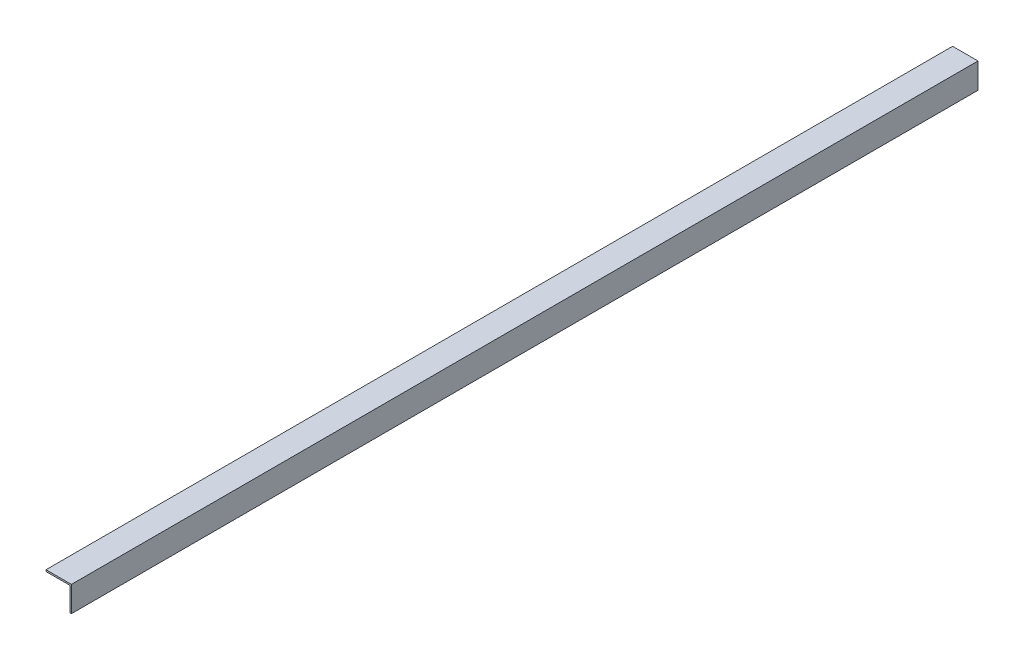
ISO-10303-21;
HEADER;
FILE_DESCRIPTION(('STEP AP214'),'2;1');
FILE_NAME('part.step','',(''),(''),'','','');
FILE_SCHEMA(('AUTOMOTIVE_DESIGN { 1 0 10303 214 1 1 1 1 }'));
ENDSEC;
DATA;
#1=APPLICATION_CONTEXT('core data for automotive mechanical design processes');
#2=APPLICATION_PROTOCOL_DEFINITION('international standard','automotive_design',2000,#1);
#3=PRODUCT_CONTEXT('',#1,'mechanical');
#4=PRODUCT('Part','Part','',(#3));
#5=PRODUCT_RELATED_PRODUCT_CATEGORY('part','',(#4));
#6=PRODUCT_DEFINITION_FORMATION('','',#4);
#7=PRODUCT_DEFINITION_CONTEXT('part definition',#1,'design');
#8=PRODUCT_DEFINITION('design','',#6,#7);
#9=PRODUCT_DEFINITION_SHAPE('','',#8);
#10=(LENGTH_UNIT() NAMED_UNIT(*) SI_UNIT(.MILLI.,.METRE.));
#11=(NAMED_UNIT(*) PLANE_ANGLE_UNIT() SI_UNIT($,.RADIAN.));
#12=(NAMED_UNIT(*) SI_UNIT($,.STERADIAN.) SOLID_ANGLE_UNIT());
#13=UNCERTAINTY_MEASURE_WITH_UNIT(LENGTH_MEASURE(1.E-05),#10,'distance_accuracy_value','');
#14=(GEOMETRIC_REPRESENTATION_CONTEXT(3) GLOBAL_UNCERTAINTY_ASSIGNED_CONTEXT((#13)) GLOBAL_UNIT_ASSIGNED_CONTEXT((#10,
#11,#12)) REPRESENTATION_CONTEXT('',''));
#15=CARTESIAN_POINT('',(0.,0.,0.));
#16=DIRECTION('',(0.,0.,1.));
#17=DIRECTION('',(1.,0.,0.));
#18=AXIS2_PLACEMENT_3D('',#15,#16,#17);
#19=CARTESIAN_POINT('',(0.,-50.8,1812.925));
#20=DIRECTION('',(-1.,0.,0.));
#21=DIRECTION('',(0.,0.,1.));
#22=AXIS2_PLACEMENT_3D('',#19,#20,#21);
#23=PLANE('',#22);
#24=DIRECTION('',(0.,1.,0.));
#25=VECTOR('',#24,1.);
#26=CARTESIAN_POINT('',(0.,-50.8,0.));
#27=LINE('',#26,#25);
#28=CARTESIAN_POINT('',(0.,-50.8,0.));
#29=VERTEX_POINT('',#28);
#30=CARTESIAN_POINT('',(0.,0.,0.));
#31=VERTEX_POINT('',#30);
#32=EDGE_CURVE('E123',#29,#31,#27,.T.);
#33=ORIENTED_EDGE('',*,*,#32,.T.);
#34=DIRECTION('',(0.,0.,-1.));
#35=VECTOR('',#34,1.);
#36=CARTESIAN_POINT('',(0.,0.,1812.925));
#37=LINE('',#36,#35);
#38=CARTESIAN_POINT('',(0.,0.,1812.925));
#39=VERTEX_POINT('',#38);
#40=EDGE_CURVE('E11',#39,#31,#37,.T.);
#41=ORIENTED_EDGE('',*,*,#40,.F.);
#42=DIRECTION('',(0.,1.,0.));
#43=VECTOR('',#42,1.);
#44=CARTESIAN_POINT('',(0.,-50.8,1812.925));
#45=LINE('',#44,#43);
#46=CARTESIAN_POINT('',(0.,-50.8,1812.925));
#47=VERTEX_POINT('',#46);
#48=EDGE_CURVE('E133',#47,#39,#45,.T.);
#49=ORIENTED_EDGE('',*,*,#48,.F.);
#50=DIRECTION('',(0.,0.,-1.));
#51=VECTOR('',#50,1.);
#52=CARTESIAN_POINT('',(0.,-50.8,1812.925));
#53=LINE('',#52,#51);
#54=EDGE_CURVE('E119',#47,#29,#53,.T.);
#55=ORIENTED_EDGE('',*,*,#54,.T.);
#56=EDGE_LOOP('',(#33,#41,#49,#55));
#57=FACE_BOUND('',#56,.T.);
#58=ADVANCED_FACE('F39',(#57),#23,.F.);
#59=CARTESIAN_POINT('',(0.,0.,1812.925));
#60=DIRECTION('',(0.,-1.,0.));
#61=DIRECTION('',(0.,0.,-1.));
#62=AXIS2_PLACEMENT_3D('',#59,#60,#61);
#63=PLANE('',#62);
#64=DIRECTION('',(-1.,0.,0.));
#65=VECTOR('',#64,1.);
#66=CARTESIAN_POINT('',(0.,0.,0.));
#67=LINE('',#66,#65);
#68=CARTESIAN_POINT('',(-50.8,0.,0.));
#69=VERTEX_POINT('',#68);
#70=EDGE_CURVE('E126',#31,#69,#67,.T.);
#71=ORIENTED_EDGE('',*,*,#70,.T.);
#72=DIRECTION('',(0.,0.,-1.));
#73=VECTOR('',#72,1.);
#74=CARTESIAN_POINT('',(-50.8,0.,1812.925));
#75=LINE('',#74,#73);
#76=CARTESIAN_POINT('',(-50.8,0.,1812.925));
#77=VERTEX_POINT('',#76);
#78=EDGE_CURVE('E47',#77,#69,#75,.T.);
#79=ORIENTED_EDGE('',*,*,#78,.F.);
#80=DIRECTION('',(-1.,0.,0.));
#81=VECTOR('',#80,1.);
#82=CARTESIAN_POINT('',(0.,0.,1812.925));
#83=LINE('',#82,#81);
#84=EDGE_CURVE('E92',#39,#77,#83,.T.);
#85=ORIENTED_EDGE('',*,*,#84,.F.);
#86=ORIENTED_EDGE('',*,*,#40,.T.);
#87=EDGE_LOOP('',(#71,#79,#85,#86));
#88=FACE_BOUND('',#87,.T.);
#89=ADVANCED_FACE('F157',(#88),#63,.F.);
#90=CARTESIAN_POINT('',(-50.8,0.,1812.925));
#91=DIRECTION('',(1.,0.,0.));
#92=DIRECTION('',(0.,0.,-1.));
#93=AXIS2_PLACEMENT_3D('',#90,#91,#92);
#94=PLANE('',#93);
#95=DIRECTION('',(0.,-1.,0.));
#96=VECTOR('',#95,1.);
#97=CARTESIAN_POINT('',(-50.8,0.,0.));
#98=LINE('',#97,#96);
#99=CARTESIAN_POINT('',(-50.8,-3.17500000000001,0.));
#100=VERTEX_POINT('',#99);
#101=EDGE_CURVE('E128',#69,#100,#98,.T.);
#102=ORIENTED_EDGE('',*,*,#101,.T.);
#103=DIRECTION('',(0.,0.,-1.));
#104=VECTOR('',#103,1.);
#105=CARTESIAN_POINT('',(-50.8,-3.17500000000001,1812.925));
#106=LINE('',#105,#104);
#107=CARTESIAN_POINT('',(-50.8,-3.17500000000001,1812.925));
#108=VERTEX_POINT('',#107);
#109=EDGE_CURVE('E114',#108,#100,#106,.T.);
#110=ORIENTED_EDGE('',*,*,#109,.F.);
#111=DIRECTION('',(0.,-1.,0.));
#112=VECTOR('',#111,1.);
#113=CARTESIAN_POINT('',(-50.8,0.,1812.925));
#114=LINE('',#113,#112);
#115=EDGE_CURVE('E105',#77,#108,#114,.T.);
#116=ORIENTED_EDGE('',*,*,#115,.F.);
#117=ORIENTED_EDGE('',*,*,#78,.T.);
#118=EDGE_LOOP('',(#102,#110,#116,#117));
#119=FACE_BOUND('',#118,.T.);
#120=ADVANCED_FACE('F139',(#119),#94,.F.);
#121=CARTESIAN_POINT('',(-50.8,-3.17500000000001,1812.925));
#122=DIRECTION('',(0.,1.,0.));
#123=DIRECTION('',(0.,0.,1.));
#124=AXIS2_PLACEMENT_3D('',#121,#122,#123);
#125=PLANE('',#124);
#126=DIRECTION('',(1.,0.,0.));
#127=VECTOR('',#126,1.);
#128=CARTESIAN_POINT('',(-50.8,-3.17500000000001,0.));
#129=LINE('',#128,#127);
#130=CARTESIAN_POINT('',(-3.17500000000001,-3.17500000000001,0.));
#131=VERTEX_POINT('',#130);
#132=EDGE_CURVE('E113',#100,#131,#129,.T.);
#133=ORIENTED_EDGE('',*,*,#132,.T.);
#134=DIRECTION('',(0.,0.,-1.));
#135=VECTOR('',#134,1.);
#136=CARTESIAN_POINT('',(-3.17500000000001,-3.17500000000001,1812.925));
#137=LINE('',#136,#135);
#138=CARTESIAN_POINT('',(-3.17500000000001,-3.17500000000001,1812.925));
#139=VERTEX_POINT('',#138);
#140=EDGE_CURVE('E110',#139,#131,#137,.T.);
#141=ORIENTED_EDGE('',*,*,#140,.F.);
#142=DIRECTION('',(1.,0.,0.));
#143=VECTOR('',#142,1.);
#144=CARTESIAN_POINT('',(-50.8,-3.17500000000001,1812.925));
#145=LINE('',#144,#143);
#146=EDGE_CURVE('E99',#108,#139,#145,.T.);
#147=ORIENTED_EDGE('',*,*,#146,.F.);
#148=ORIENTED_EDGE('',*,*,#109,.T.);
#149=EDGE_LOOP('',(#133,#141,#147,#148));
#150=FACE_BOUND('',#149,.T.);
#151=ADVANCED_FACE('F111',(#150),#125,.F.);
#152=CARTESIAN_POINT('',(-3.17500000000001,-3.17500000000001,1812.925));
#153=DIRECTION('',(1.,0.,0.));
#154=DIRECTION('',(0.,1.,0.));
#155=AXIS2_PLACEMENT_3D('',#152,#153,#154);
#156=PLANE('',#155);
#157=DIRECTION('',(0.,-1.,0.));
#158=VECTOR('',#157,1.);
#159=CARTESIAN_POINT('',(-3.17500000000001,-3.17500000000001,0.));
#160=LINE('',#159,#158);
#161=CARTESIAN_POINT('',(-3.175,-50.8,0.));
#162=VERTEX_POINT('',#161);
#163=EDGE_CURVE('E78',#131,#162,#160,.T.);
#164=ORIENTED_EDGE('',*,*,#163,.T.);
#165=DIRECTION('',(0.,0.,-1.));
#166=VECTOR('',#165,1.);
#167=CARTESIAN_POINT('',(-3.175,-50.8,1812.925));
#168=LINE('',#167,#166);
#169=CARTESIAN_POINT('',(-3.175,-50.8,1812.925));
#170=VERTEX_POINT('',#169);
#171=EDGE_CURVE('E115',#170,#162,#168,.T.);
#172=ORIENTED_EDGE('',*,*,#171,.F.);
#173=DIRECTION('',(0.,-1.,0.));
#174=VECTOR('',#173,1.);
#175=CARTESIAN_POINT('',(-3.17500000000001,-3.17500000000001,1812.925));
#176=LINE('',#175,#174);
#177=EDGE_CURVE('E103',#139,#170,#176,.T.);
#178=ORIENTED_EDGE('',*,*,#177,.F.);
#179=ORIENTED_EDGE('',*,*,#140,.T.);
#180=EDGE_LOOP('',(#164,#172,#178,#179));
#181=FACE_BOUND('',#180,.T.);
#182=ADVANCED_FACE('F117',(#181),#156,.F.);
#183=CARTESIAN_POINT('',(-3.175,-50.8,1812.925));
#184=DIRECTION('',(0.,1.,0.));
#185=DIRECTION('',(0.,0.,1.));
#186=AXIS2_PLACEMENT_3D('',#183,#184,#185);
#187=PLANE('',#186);
#188=DIRECTION('',(1.,0.,0.));
#189=VECTOR('',#188,1.);
#190=CARTESIAN_POINT('',(-3.175,-50.8,0.));
#191=LINE('',#190,#189);
#192=EDGE_CURVE('E84',#162,#29,#191,.T.);
#193=ORIENTED_EDGE('',*,*,#192,.T.);
#194=ORIENTED_EDGE('',*,*,#54,.F.);
#195=DIRECTION('',(1.,0.,0.));
#196=VECTOR('',#195,1.);
#197=CARTESIAN_POINT('',(-3.175,-50.8,1812.925));
#198=LINE('',#197,#196);
#199=EDGE_CURVE('E55',#170,#47,#198,.T.);
#200=ORIENTED_EDGE('',*,*,#199,.F.);
#201=ORIENTED_EDGE('',*,*,#171,.T.);
#202=EDGE_LOOP('',(#193,#194,#200,#201));
#203=FACE_BOUND('',#202,.T.);
#204=ADVANCED_FACE('F146',(#203),#187,.F.);
#205=CARTESIAN_POINT('',(0.,0.,1812.925));
#206=DIRECTION('',(0.,0.,1.));
#207=DIRECTION('',(1.,0.,0.));
#208=AXIS2_PLACEMENT_3D('',#205,#206,#207);
#209=PLANE('',#208);
#210=ORIENTED_EDGE('',*,*,#48,.T.);
#211=ORIENTED_EDGE('',*,*,#84,.T.);
#212=ORIENTED_EDGE('',*,*,#115,.T.);
#213=ORIENTED_EDGE('',*,*,#146,.T.);
#214=ORIENTED_EDGE('',*,*,#177,.T.);
#215=ORIENTED_EDGE('',*,*,#199,.T.);
#216=EDGE_LOOP('',(#210,#211,#212,#213,#214,#215));
#217=FACE_BOUND('',#216,.T.);
#218=ADVANCED_FACE('F101',(#217),#209,.T.);
#219=CARTESIAN_POINT('',(0.,0.,0.));
#220=DIRECTION('',(0.,0.,1.));
#221=DIRECTION('',(1.,0.,0.));
#222=AXIS2_PLACEMENT_3D('',#219,#220,#221);
#223=PLANE('',#222);
#224=ORIENTED_EDGE('',*,*,#32,.F.);
#225=ORIENTED_EDGE('',*,*,#192,.F.);
#226=ORIENTED_EDGE('',*,*,#163,.F.);
#227=ORIENTED_EDGE('',*,*,#132,.F.);
#228=ORIENTED_EDGE('',*,*,#101,.F.);
#229=ORIENTED_EDGE('',*,*,#70,.F.);
#230=EDGE_LOOP('',(#224,#225,#226,#227,#228,#229));
#231=FACE_BOUND('',#230,.T.);
#232=ADVANCED_FACE('F142',(#231),#223,.F.);
#233=CLOSED_SHELL('',(#58,#89,#120,#151,#182,#204,#218,#232));
#234=MANIFOLD_SOLID_BREP('B2',#233);
#235=ADVANCED_BREP_SHAPE_REPRESENTATION('',(#18,#234),#14);
#236=SHAPE_DEFINITION_REPRESENTATION(#9,#235);
ENDSEC;
END-ISO-10303-21;
